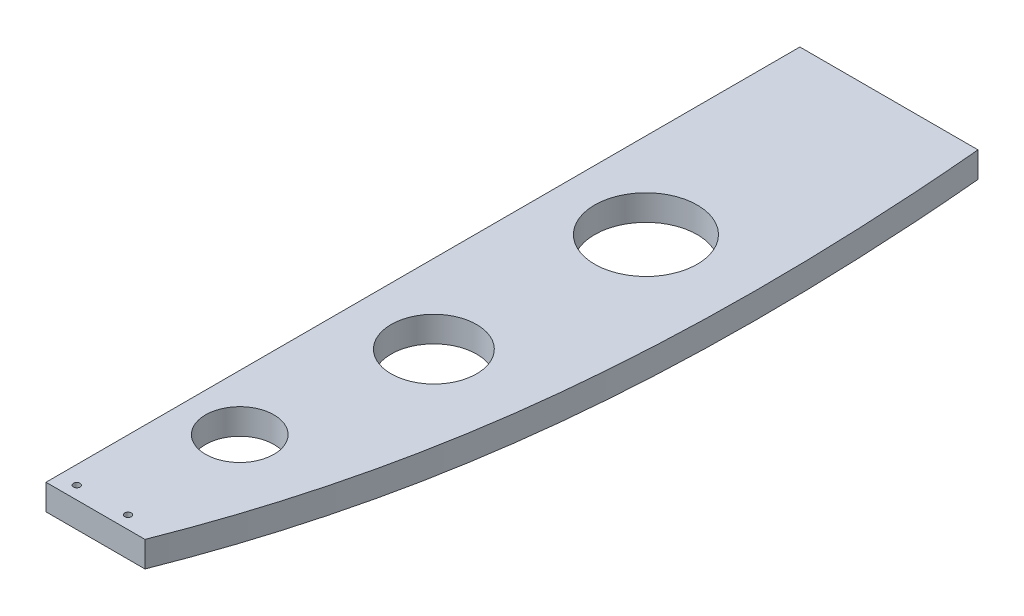
ISO-10303-21;
HEADER;
FILE_DESCRIPTION(('STEP AP214'),'2;1');
FILE_NAME('part.step','',(''),(''),'','','');
FILE_SCHEMA(('AUTOMOTIVE_DESIGN { 1 0 10303 214 1 1 1 1 }'));
ENDSEC;
DATA;
#1=APPLICATION_CONTEXT('core data for automotive mechanical design processes');
#2=APPLICATION_PROTOCOL_DEFINITION('international standard','automotive_design',2000,#1);
#3=PRODUCT_CONTEXT('',#1,'mechanical');
#4=PRODUCT('Part','Part','',(#3));
#5=PRODUCT_RELATED_PRODUCT_CATEGORY('part','',(#4));
#6=PRODUCT_DEFINITION_FORMATION('','',#4);
#7=PRODUCT_DEFINITION_CONTEXT('part definition',#1,'design');
#8=PRODUCT_DEFINITION('design','',#6,#7);
#9=PRODUCT_DEFINITION_SHAPE('','',#8);
#10=(LENGTH_UNIT() NAMED_UNIT(*) SI_UNIT(.MILLI.,.METRE.));
#11=(NAMED_UNIT(*) PLANE_ANGLE_UNIT() SI_UNIT($,.RADIAN.));
#12=(NAMED_UNIT(*) SI_UNIT($,.STERADIAN.) SOLID_ANGLE_UNIT());
#13=UNCERTAINTY_MEASURE_WITH_UNIT(LENGTH_MEASURE(1.E-05),#10,'distance_accuracy_value','');
#14=(GEOMETRIC_REPRESENTATION_CONTEXT(3) GLOBAL_UNCERTAINTY_ASSIGNED_CONTEXT((#13)) GLOBAL_UNIT_ASSIGNED_CONTEXT((#10,
#11,#12)) REPRESENTATION_CONTEXT('',''));
#15=CARTESIAN_POINT('',(0.,0.,0.));
#16=DIRECTION('',(0.,0.,1.));
#17=DIRECTION('',(1.,0.,0.));
#18=AXIS2_PLACEMENT_3D('',#15,#16,#17);
#19=CARTESIAN_POINT('',(395.938510352723,5549.90000000001,2963.39820667187));
#20=DIRECTION('',(0.,1.,0.));
#21=DIRECTION('',(-1.,0.,0.));
#22=AXIS2_PLACEMENT_3D('',#19,#20,#21);
#23=PLANE('',#22);
#24=CARTESIAN_POINT('',(376.52868175482,5549.90000000001,3233.76141324197));
#25=DIRECTION('',(0.,1.,0.));
#26=DIRECTION('',(-1.,0.,0.));
#27=AXIS2_PLACEMENT_3D('',#24,#25,#26);
#28=CIRCLE('',#27,2.45744999999997);
#29=CARTESIAN_POINT('',(374.07123175482,5549.90000000001,3233.76141324197));
#30=VERTEX_POINT('',#29);
#31=EDGE_CURVE('E494',#30,#30,#28,.T.);
#32=ORIENTED_EDGE('',*,*,#31,.T.);
#33=EDGE_LOOP('',(#32));
#34=FACE_BOUND('',#33,.T.);
#35=CARTESIAN_POINT('',(338.428578956983,5549.90000000001,3233.76141324205));
#36=DIRECTION('',(0.,1.,0.));
#37=DIRECTION('',(-1.,0.,0.));
#38=AXIS2_PLACEMENT_3D('',#35,#36,#37);
#39=CIRCLE('',#38,2.45744999999997);
#40=CARTESIAN_POINT('',(335.971128956983,5549.90000000001,3233.76141324205));
#41=VERTEX_POINT('',#40);
#42=EDGE_CURVE('E129',#41,#41,#39,.T.);
#43=ORIENTED_EDGE('',*,*,#42,.T.);
#44=EDGE_LOOP('',(#43));
#45=FACE_BOUND('',#44,.T.);
#46=CARTESIAN_POINT('',(388.619999999984,5549.90000000001,2861.31));
#47=DIRECTION('',(0.,1.,0.));
#48=DIRECTION('',(-1.,0.,0.));
#49=AXIS2_PLACEMENT_3D('',#46,#47,#48);
#50=CIRCLE('',#49,38.0999999999997);
#51=CARTESIAN_POINT('',(350.519999999984,5549.9,2861.31));
#52=VERTEX_POINT('',#51);
#53=EDGE_CURVE('E171',#52,#52,#50,.T.);
#54=ORIENTED_EDGE('',*,*,#53,.T.);
#55=EDGE_LOOP('',(#54));
#56=FACE_BOUND('',#55,.T.);
#57=CARTESIAN_POINT('',(383.539999999985,5549.90000000001,3013.71));
#58=DIRECTION('',(0.,1.,0.));
#59=DIRECTION('',(-1.,0.,0.));
#60=AXIS2_PLACEMENT_3D('',#57,#58,#59);
#61=CIRCLE('',#60,31.75);
#62=CARTESIAN_POINT('',(351.789999999985,5549.90000000001,3013.71));
#63=VERTEX_POINT('',#62);
#64=EDGE_CURVE('E519',#63,#63,#61,.T.);
#65=ORIENTED_EDGE('',*,*,#64,.T.);
#66=EDGE_LOOP('',(#65));
#67=FACE_BOUND('',#66,.T.);
#68=CARTESIAN_POINT('',(366.394999999985,5549.90000000001,3140.71));
#69=DIRECTION('',(0.,1.,0.));
#70=DIRECTION('',(-1.,0.,0.));
#71=AXIS2_PLACEMENT_3D('',#68,#69,#70);
#72=CIRCLE('',#71,25.4);
#73=CARTESIAN_POINT('',(340.994999999985,5549.90000000001,3140.71));
#74=VERTEX_POINT('',#73);
#75=EDGE_CURVE('E185',#74,#74,#72,.T.);
#76=ORIENTED_EDGE('',*,*,#75,.T.);
#77=EDGE_LOOP('',(#76));
#78=FACE_BOUND('',#77,.T.);
#79=DIRECTION('',(0.,0.,1.));
#80=VECTOR('',#79,1.);
#81=CARTESIAN_POINT('',(325.120000000001,5549.90000000001,2683.51));
#82=LINE('',#81,#80);
#83=CARTESIAN_POINT('',(325.120000000001,5549.90000000001,2683.51));
#84=VERTEX_POINT('',#83);
#85=CARTESIAN_POINT('',(325.120000000001,5549.9,3243.28641334377));
#86=VERTEX_POINT('',#85);
#87=EDGE_CURVE('E177',#84,#86,#82,.T.);
#88=ORIENTED_EDGE('',*,*,#87,.F.);
#89=DIRECTION('',(-1.,0.,0.));
#90=VECTOR('',#89,1.);
#91=CARTESIAN_POINT('',(457.383176281735,5549.9,2683.51));
#92=LINE('',#91,#90);
#93=CARTESIAN_POINT('',(457.383176281735,5549.90000000001,2683.51));
#94=VERTEX_POINT('',#93);
#95=EDGE_CURVE('E178',#94,#84,#92,.T.);
#96=ORIENTED_EDGE('',*,*,#95,.F.);
#97=CARTESIAN_POINT('',(398.616067459075,5549.90000000001,3243.28641334377));
#98=CARTESIAN_POINT('',(399.39125435425,5549.90000000001,3241.31643941946));
#99=CARTESIAN_POINT('',(400.159771946542,5549.90000000001,3239.34384037501));
#100=CARTESIAN_POINT('',(401.683308273387,5549.90000000001,3235.39352604281));
#101=CARTESIAN_POINT('',(402.438327540985,5549.90000000001,3233.41581096063));
#102=CARTESIAN_POINT('',(403.934753074234,5549.90000000001,3229.45528302953));
#103=CARTESIAN_POINT('',(404.676159617437,5549.90000000001,3227.47247028548));
#104=CARTESIAN_POINT('',(406.145485254066,5549.90000000001,3223.50115186715));
#105=CARTESIAN_POINT('',(406.873400073381,5549.90000000001,3221.51264461165));
#106=CARTESIAN_POINT('',(408.31540959548,5549.90000000001,3217.53057616089));
#107=CARTESIAN_POINT('',(409.029504010927,5549.90000000001,3215.53701486152));
#108=CARTESIAN_POINT('',(410.443784650398,5549.90000000001,3211.54487773682));
#109=CARTESIAN_POINT('',(411.143970279184,5549.90000000001,3209.54630170097));
#110=CARTESIAN_POINT('',(413.924796825675,5549.90000000001,3201.51873163861));
#111=CARTESIAN_POINT('',(415.948841486583,5549.90000000001,3195.46999950884));
#112=CARTESIAN_POINT('',(419.867867500471,5549.9,3183.33007269645));
#113=CARTESIAN_POINT('',(421.762832082676,5549.9,3177.23887260906));
#114=CARTESIAN_POINT('',(425.422427121146,5549.9,3165.01700514526));
#115=CARTESIAN_POINT('',(427.187049310553,5549.9,3158.88633529227));
#116=CARTESIAN_POINT('',(430.585512685609,5549.9,3146.58889174867));
#117=CARTESIAN_POINT('',(432.219354382258,5549.9,3140.42211819922));
#118=CARTESIAN_POINT('',(435.357372122893,5549.9,3128.05321738844));
#119=CARTESIAN_POINT('',(436.861499329011,5549.9,3121.85107774053));
#120=CARTESIAN_POINT('',(439.740649568869,5549.9,3109.41710957125));
#121=CARTESIAN_POINT('',(441.115676283979,5549.9,3103.18528190178));
#122=CARTESIAN_POINT('',(443.738657817966,5549.9,3090.69501786939));
#123=CARTESIAN_POINT('',(444.986613882393,5549.9,3084.43658176792));
#124=CARTESIAN_POINT('',(447.358070937326,5549.9,3071.89634733286));
#125=CARTESIAN_POINT('',(448.481574270178,5549.90000000001,3065.61454944128));
#126=CARTESIAN_POINT('',(450.959202772402,5549.90000000001,3050.94728471009));
#127=CARTESIAN_POINT('',(452.266536668404,5549.90000000001,3042.553883485));
#128=CARTESIAN_POINT('',(454.674970323465,5549.9,3025.73760485585));
#129=CARTESIAN_POINT('',(455.776068123823,5549.9,3017.3147271726));
#130=CARTESIAN_POINT('',(457.781734473297,5549.9,3000.44559812988));
#131=CARTESIAN_POINT('',(458.686301386226,5549.9,2991.99934657639));
#132=CARTESIAN_POINT('',(460.309158182782,5549.9,2975.08983570134));
#133=CARTESIAN_POINT('',(461.027464844443,5549.9,2966.62657798091));
#134=CARTESIAN_POINT('',(462.288581630137,5549.9,2949.68715658898));
#135=CARTESIAN_POINT('',(462.831394684958,5549.9,2941.21099313539));
#136=CARTESIAN_POINT('',(463.522040592226,5549.9,2928.49034900381));
#137=CARTESIAN_POINT('',(463.731658636719,5549.9,2924.2491150432));
#138=CARTESIAN_POINT('',(464.111045111049,5549.90000000001,2915.76485644083));
#139=CARTESIAN_POINT('',(464.280813611038,5549.90000000001,2911.52183180224));
#140=CARTESIAN_POINT('',(464.54389378274,5549.90000000001,2904.10341936462));
#141=CARTESIAN_POINT('',(464.645692509933,5549.9,2900.92832853059));
#142=CARTESIAN_POINT('',(464.782642510266,5549.9,2896.16524637707));
#143=CARTESIAN_POINT('',(464.825667804946,5549.9,2894.57747907897));
#144=CARTESIAN_POINT('',(464.906437301378,5549.9,2891.40180867515));
#145=CARTESIAN_POINT('',(464.944181497303,5549.9,2889.81390556928));
#146=CARTESIAN_POINT('',(465.049630713982,5549.9,2885.05012986422));
#147=CARTESIAN_POINT('',(465.109555502827,5549.9,2881.87408139542));
#148=CARTESIAN_POINT('',(465.209293669797,5549.9,2875.52166888438));
#149=CARTESIAN_POINT('',(465.24910699861,5549.9,2872.34530484138));
#150=CARTESIAN_POINT('',(465.339279193303,5549.9,2862.81707241095));
#151=CARTESIAN_POINT('',(465.360395446423,5549.9,2856.46490585253));
#152=CARTESIAN_POINT('',(465.328911747633,5549.9,2843.76069302108));
#153=CARTESIAN_POINT('',(465.276310667107,5549.90000000001,2837.40864675138));
#154=CARTESIAN_POINT('',(465.103717150511,5549.90000000001,2824.90056477656));
#155=CARTESIAN_POINT('',(464.985843659627,5549.9,2818.74449953624));
#156=CARTESIAN_POINT('',(464.687072530092,5549.9,2806.4337998571));
#157=CARTESIAN_POINT('',(464.506173786314,5549.9,2800.27916544525));
#158=CARTESIAN_POINT('',(464.08372728867,5549.9,2787.97184820663));
#159=CARTESIAN_POINT('',(463.842178185526,5549.9,2781.81916542631));
#160=CARTESIAN_POINT('',(463.300390781292,5549.9,2769.51628781189));
#161=CARTESIAN_POINT('',(463.000151506004,5549.9,2763.36609302079));
#162=CARTESIAN_POINT('',(462.342479114976,5549.9,2751.06749509507));
#163=CARTESIAN_POINT('',(461.985034229911,5549.9,2744.91909259054));
#164=CARTESIAN_POINT('',(461.214161076097,5549.9,2732.62589828629));
#165=CARTESIAN_POINT('',(460.80073366799,5549.9,2726.48110643251));
#166=CARTESIAN_POINT('',(459.918658659863,5549.9,2714.19573926707));
#167=CARTESIAN_POINT('',(459.450013380929,5549.9,2708.05516378909));
#168=CARTESIAN_POINT('',(458.705858250389,5549.9,2698.84786595679));
#169=CARTESIAN_POINT('',(458.450951410518,5549.9,2695.77946560644));
#170=CARTESIAN_POINT('',(457.927384186114,5549.9,2689.64383870023));
#171=CARTESIAN_POINT('',(457.658723802266,5549.90000000001,2686.57661214431));
#172=CARTESIAN_POINT('',(457.383176281735,5549.90000000001,2683.51));
#173=B_SPLINE_CURVE_WITH_KNOTS('',3,(#97,#98,#99,#100,#101,#102,#103,#104,#105,#106,#107,#108,
#109,#110,#111,#112,#113,#114,#115,#116,#117,#118,#119,#120,#121,#122,#123,#124,#125,#126,#127,
#128,#129,#130,#131,#132,#133,#134,#135,#136,#137,#138,#139,#140,#141,#142,#143,#144,#145,#146,
#147,#148,#149,#150,#151,#152,#153,#154,#155,#156,#157,#158,#159,#160,#161,#162,#163,#164,#165,
#166,#167,#168,#169,#170,#171,#172),.UNSPECIFIED.,.F.,.F.,(4,2,2,2,2,2,2,2,2,2,2,2,2,2,2,2,2,2,
2,2,2,2,2,2,2,2,2,2,2,2,2,2,2,2,2,2,2,4),(0.,6.35100513389873,12.7017589115667,19.0523830586232,
25.4049858028804,31.7577204810335,38.1107264467625,57.2443005221599,76.3803558108261,
95.5176237474079,114.654816904936,133.799184095803,152.943005208753,172.086638655153,
191.229911734633,216.710911962582,242.192154180931,267.673608531117,293.152766753605,
318.631499445493,331.370582215211,344.109642558367,353.639740098638,358.404782446425,
363.169830052399,372.699596689318,382.229386692556,401.285492509783,420.341890080029,
438.813133582084,457.284700987462,475.756679362759,494.228964380042,512.705054731664,
531.18086107531,549.655891064216,558.892775373888,568.129659224018),.UNSPECIFIED.);
#174=CARTESIAN_POINT('',(398.616067459075,5549.90000000001,3243.28641334377));
#175=VERTEX_POINT('',#174);
#176=EDGE_CURVE('E96',#175,#94,#173,.T.);
#177=ORIENTED_EDGE('',*,*,#176,.F.);
#178=DIRECTION('',(1.,0.,0.));
#179=VECTOR('',#178,1.);
#180=CARTESIAN_POINT('',(325.120000000001,5549.9,3243.28641334377));
#181=LINE('',#180,#179);
#182=EDGE_CURVE('E203',#86,#175,#181,.T.);
#183=ORIENTED_EDGE('',*,*,#182,.F.);
#184=EDGE_LOOP('',(#88,#96,#177,#183));
#185=FACE_BOUND('',#184,.T.);
#186=ADVANCED_FACE('F50',(#34,#45,#56,#67,#78,#185),#23,.F.);
#187=CARTESIAN_POINT('',(325.120000000001,5549.9,3243.28641334377));
#188=DIRECTION('',(0.,0.,1.));
#189=DIRECTION('',(1.,0.,0.));
#190=AXIS2_PLACEMENT_3D('',#187,#188,#189);
#191=PLANE('',#190);
#192=DIRECTION('',(-1.,0.,0.));
#193=VECTOR('',#192,1.);
#194=CARTESIAN_POINT('',(395.938510352722,5568.95,3243.28641334377));
#195=LINE('',#194,#193);
#196=CARTESIAN_POINT('',(325.120000000001,5568.95000000001,3243.28641334377));
#197=VERTEX_POINT('',#196);
#198=CARTESIAN_POINT('',(398.616067459078,5568.95000000001,3243.28641334377));
#199=VERTEX_POINT('',#198);
#200=EDGE_CURVE('E168',#197,#199,#195,.F.);
#201=ORIENTED_EDGE('',*,*,#200,.F.);
#202=DIRECTION('',(0.,-1.,0.));
#203=VECTOR('',#202,1.);
#204=CARTESIAN_POINT('',(325.120000000001,5549.9,3243.28641334377));
#205=LINE('',#204,#203);
#206=EDGE_CURVE('E186',#86,#197,#205,.F.);
#207=ORIENTED_EDGE('',*,*,#206,.F.);
#208=ORIENTED_EDGE('',*,*,#182,.T.);
#209=DIRECTION('',(-1.36946010087513E-13,-1.,0.));
#210=VECTOR('',#209,1.);
#211=CARTESIAN_POINT('',(398.616067459077,5559.425,3243.28641334377));
#212=LINE('',#211,#210);
#213=EDGE_CURVE('E189',#199,#175,#212,.T.);
#214=ORIENTED_EDGE('',*,*,#213,.F.);
#215=EDGE_LOOP('',(#201,#207,#208,#214));
#216=FACE_BOUND('',#215,.T.);
#217=ADVANCED_FACE('F247',(#216),#191,.T.);
#218=CARTESIAN_POINT('',(398.616067459075,5549.90000000001,3243.28641334377));
#219=CARTESIAN_POINT('',(398.616067459078,5568.95000000001,3243.28641334377));
#220=CARTESIAN_POINT('',(438.958601174541,5549.90000000001,3140.76412449457));
#221=CARTESIAN_POINT('',(438.958601174543,5568.95000000001,3140.76412449457));
#222=CARTESIAN_POINT('',(461.136779739803,5549.90000000001,3031.41462020299));
#223=CARTESIAN_POINT('',(461.136779739804,5568.95000000001,3031.41462020298));
#224=CARTESIAN_POINT('',(466.748734721919,5549.90000000001,2823.19952309335));
#225=CARTESIAN_POINT('',(466.748734721919,5568.95000000001,2823.19952309334));
#226=CARTESIAN_POINT('',(463.282210542619,5549.90000000001,2749.16015817367));
#227=CARTESIAN_POINT('',(463.282210542618,5568.95000000001,2749.16015817367));
#228=CARTESIAN_POINT('',(457.383176281735,5549.9,2683.51));
#229=CARTESIAN_POINT('',(457.383176281734,5568.95000000001,2683.51));
#230=B_SPLINE_SURFACE_WITH_KNOTS('',3,1,((#218,#219),(#220,#221),(#222,#223),(#224,#225),(#226,
#227),(#228,#229)),.UNSPECIFIED.,.F.,.F.,.F.,(4,2,4),(2,2),(-55.3716029639308,-25.0699273348478,
-9.0667694452729),(0.,1.90499999999997),.UNSPECIFIED.);
#231=CARTESIAN_POINT('',(398.616067459077,5568.95000000001,3243.28641334377));
#232=CARTESIAN_POINT('',(399.391254354253,5568.95000000001,3241.31643941946));
#233=CARTESIAN_POINT('',(400.159771946545,5568.95000000001,3239.34384037501));
#234=CARTESIAN_POINT('',(401.68330827339,5568.95000000001,3235.39352604281));
#235=CARTESIAN_POINT('',(402.438327540988,5568.95000000001,3233.41581096063));
#236=CARTESIAN_POINT('',(403.934753074237,5568.95000000001,3229.45528302953));
#237=CARTESIAN_POINT('',(404.67615961744,5568.95000000001,3227.47247028548));
#238=CARTESIAN_POINT('',(406.145485254069,5568.95000000001,3223.50115186715));
#239=CARTESIAN_POINT('',(406.873400073384,5568.95000000001,3221.51264461165));
#240=CARTESIAN_POINT('',(408.315409595483,5568.95000000001,3217.53057616089));
#241=CARTESIAN_POINT('',(409.02950401093,5568.95000000001,3215.53701486152));
#242=CARTESIAN_POINT('',(410.443784650401,5568.95000000001,3211.54487773681));
#243=CARTESIAN_POINT('',(411.143970279187,5568.95000000001,3209.54630170097));
#244=CARTESIAN_POINT('',(413.924796825676,5568.95000000001,3201.51873163861));
#245=CARTESIAN_POINT('',(415.948841486585,5568.95000000001,3195.46999950884));
#246=CARTESIAN_POINT('',(419.867867500474,5568.95000000001,3183.33007269644));
#247=CARTESIAN_POINT('',(421.762832082679,5568.95000000001,3177.23887260906));
#248=CARTESIAN_POINT('',(425.422427121148,5568.95000000001,3165.01700514526));
#249=CARTESIAN_POINT('',(427.187049310556,5568.95000000001,3158.88633529227));
#250=CARTESIAN_POINT('',(430.585512685611,5568.95000000001,3146.58889174867));
#251=CARTESIAN_POINT('',(432.219354382261,5568.95000000001,3140.42211819922));
#252=CARTESIAN_POINT('',(435.357372122895,5568.95000000001,3128.05321738843));
#253=CARTESIAN_POINT('',(436.861499329013,5568.95000000001,3121.85107774053));
#254=CARTESIAN_POINT('',(439.740649568871,5568.95000000001,3109.41710957125));
#255=CARTESIAN_POINT('',(441.115676283981,5568.95000000001,3103.18528190178));
#256=CARTESIAN_POINT('',(443.738657817968,5568.95000000001,3090.69501786939));
#257=CARTESIAN_POINT('',(444.986613882395,5568.95000000001,3084.43658176791));
#258=CARTESIAN_POINT('',(447.358070937328,5568.95000000001,3071.89634733286));
#259=CARTESIAN_POINT('',(448.481574270179,5568.95000000001,3065.61454944128));
#260=CARTESIAN_POINT('',(450.959202772402,5568.95000000001,3050.94728471009));
#261=CARTESIAN_POINT('',(452.266536668405,5568.95000000001,3042.553883485));
#262=CARTESIAN_POINT('',(454.674970323467,5568.95000000001,3025.73760485585));
#263=CARTESIAN_POINT('',(455.776068123825,5568.95000000001,3017.3147271726));
#264=CARTESIAN_POINT('',(457.781734473297,5568.95000000001,3000.44559812987));
#265=CARTESIAN_POINT('',(458.686301386227,5568.95000000001,2991.99934657639));
#266=CARTESIAN_POINT('',(460.309158182783,5568.95000000001,2975.08983570133));
#267=CARTESIAN_POINT('',(461.027464844444,5568.95000000001,2966.62657798091));
#268=CARTESIAN_POINT('',(462.288581630137,5568.95000000001,2949.68715658898));
#269=CARTESIAN_POINT('',(462.831394684958,5568.95000000001,2941.21099313538));
#270=CARTESIAN_POINT('',(463.522040592227,5568.95000000001,2928.49034900381));
#271=CARTESIAN_POINT('',(463.73165863672,5568.95,2924.2491150432));
#272=CARTESIAN_POINT('',(464.111045111049,5568.95000000001,2915.76485644083));
#273=CARTESIAN_POINT('',(464.280813611037,5568.95000000001,2911.52183180224));
#274=CARTESIAN_POINT('',(464.543893782738,5568.95000000001,2904.10341936462));
#275=CARTESIAN_POINT('',(464.645692509933,5568.95000000001,2900.92832853059));
#276=CARTESIAN_POINT('',(464.782642510266,5568.95000000001,2896.16524637706));
#277=CARTESIAN_POINT('',(464.825667804946,5568.95000000001,2894.57747907896));
#278=CARTESIAN_POINT('',(464.906437301378,5568.95000000001,2891.40180867514));
#279=CARTESIAN_POINT('',(464.944181497303,5568.95000000001,2889.81390556928));
#280=CARTESIAN_POINT('',(465.049630713982,5568.95000000001,2885.05012986421));
#281=CARTESIAN_POINT('',(465.109555502827,5568.95000000001,2881.87408139542));
#282=CARTESIAN_POINT('',(465.209293669797,5568.95000000001,2875.52166888438));
#283=CARTESIAN_POINT('',(465.24910699861,5568.95000000001,2872.34530484138));
#284=CARTESIAN_POINT('',(465.339279193303,5568.95000000001,2862.81707241095));
#285=CARTESIAN_POINT('',(465.360395446423,5568.95000000001,2856.46490585253));
#286=CARTESIAN_POINT('',(465.328911747633,5568.95000000001,2843.76069302108));
#287=CARTESIAN_POINT('',(465.276310667106,5568.95000000001,2837.40864675138));
#288=CARTESIAN_POINT('',(465.10371715051,5568.95000000001,2824.90056477656));
#289=CARTESIAN_POINT('',(464.985843659626,5568.95000000001,2818.74449953624));
#290=CARTESIAN_POINT('',(464.687072530091,5568.95000000001,2806.43379985709));
#291=CARTESIAN_POINT('',(464.506173786314,5568.95000000001,2800.27916544525));
#292=CARTESIAN_POINT('',(464.08372728867,5568.95000000001,2787.97184820662));
#293=CARTESIAN_POINT('',(463.842178185526,5568.95000000001,2781.81916542631));
#294=CARTESIAN_POINT('',(463.300390781291,5568.95000000001,2769.51628781189));
#295=CARTESIAN_POINT('',(463.000151506003,5568.95000000001,2763.36609302079));
#296=CARTESIAN_POINT('',(462.342479114976,5568.95000000001,2751.06749509507));
#297=CARTESIAN_POINT('',(461.985034229911,5568.95000000001,2744.91909259054));
#298=CARTESIAN_POINT('',(461.214161076097,5568.95000000001,2732.62589828629));
#299=CARTESIAN_POINT('',(460.800733667989,5568.95000000001,2726.48110643251));
#300=CARTESIAN_POINT('',(459.918658659862,5568.95000000001,2714.19573926707));
#301=CARTESIAN_POINT('',(459.450013380929,5568.95000000001,2708.05516378908));
#302=CARTESIAN_POINT('',(458.705858250388,5568.95000000001,2698.84786595679));
#303=CARTESIAN_POINT('',(458.450951410518,5568.95000000001,2695.77946560644));
#304=CARTESIAN_POINT('',(457.927384186114,5568.95000000001,2689.64383870023));
#305=CARTESIAN_POINT('',(457.658723802266,5568.95000000001,2686.57661214431));
#306=CARTESIAN_POINT('',(457.383176281735,5568.95000000001,2683.51));
#307=B_SPLINE_CURVE_WITH_KNOTS('',3,(#231,#232,#233,#234,#235,#236,#237,#238,#239,#240,#241,
#242,#243,#244,#245,#246,#247,#248,#249,#250,#251,#252,#253,#254,#255,#256,#257,#258,#259,#260,
#261,#262,#263,#264,#265,#266,#267,#268,#269,#270,#271,#272,#273,#274,#275,#276,#277,#278,#279,
#280,#281,#282,#283,#284,#285,#286,#287,#288,#289,#290,#291,#292,#293,#294,#295,#296,#297,#298,
#299,#300,#301,#302,#303,#304,#305,#306),.UNSPECIFIED.,.F.,.F.,(4,2,2,2,2,2,2,2,2,2,2,2,2,2,2,2,
2,2,2,2,2,2,2,2,2,2,2,2,2,2,2,2,2,2,2,2,2,4),(0.,6.35100513389902,12.7017589115678,
19.0523830586243,25.4049858028811,31.757720481036,38.1107264467646,57.2443005221618,
76.3803558108284,95.5176237474105,114.654816904938,133.799184095806,152.943005208755,
172.086638655155,191.229911734635,216.710911962584,242.192154180932,267.673608531119,
293.152766753607,318.631499445496,331.370582215213,344.109642558369,353.639740098641,
358.404782446427,363.169830052401,372.69959668932,382.229386692558,401.285492509785,
420.341890080031,438.813133582085,457.284700987464,475.756679362759,494.228964380042,
512.705054731665,531.18086107531,549.655891064216,558.892775373888,568.129659224018),.UNSPECIFIED.);
#308=CARTESIAN_POINT('',(457.383176281735,5568.95000000001,2683.51));
#309=VERTEX_POINT('',#308);
#310=EDGE_CURVE('E165',#199,#309,#307,.T.);
#311=DIRECTION('',(0.,1.,0.));
#312=VECTOR('',#311,1.);
#313=CARTESIAN_POINT('',(457.383176281735,5549.9,2683.51));
#314=LINE('',#313,#312);
#315=EDGE_CURVE('E174',#309,#94,#314,.F.);
#316=ORIENTED_EDGE('',*,*,#310,.F.);
#317=ORIENTED_EDGE('',*,*,#213,.T.);
#318=ORIENTED_EDGE('',*,*,#176,.T.);
#319=ORIENTED_EDGE('',*,*,#315,.F.);
#320=EDGE_LOOP('',(#316,#317,#318,#319));
#321=FACE_BOUND('',#320,.T.);
#322=ADVANCED_FACE('F52',(#321),#230,.T.);
#323=CARTESIAN_POINT('',(457.383176281735,5549.9,2683.51));
#324=DIRECTION('',(0.,0.,-1.));
#325=DIRECTION('',(-1.,0.,0.));
#326=AXIS2_PLACEMENT_3D('',#323,#324,#325);
#327=PLANE('',#326);
#328=CARTESIAN_POINT('',(424.072610901229,5559.42500000001,2683.51));
#329=DIRECTION('',(0.,0.,-1.));
#330=DIRECTION('',(-1.,0.,0.));
#331=AXIS2_PLACEMENT_3D('',#328,#329,#330);
#332=CIRCLE('',#331,0.991870000000006);
#333=CARTESIAN_POINT('',(423.080740901229,5559.42500000001,2683.51));
#334=VERTEX_POINT('',#333);
#335=EDGE_CURVE('E156',#334,#334,#332,.T.);
#336=ORIENTED_EDGE('',*,*,#335,.F.);
#337=EDGE_LOOP('',(#336));
#338=FACE_BOUND('',#337,.T.);
#339=CARTESIAN_POINT('',(358.104203633743,5559.42500000001,2683.51));
#340=DIRECTION('',(0.,0.,-1.));
#341=DIRECTION('',(-1.,0.,0.));
#342=AXIS2_PLACEMENT_3D('',#339,#340,#341);
#343=CIRCLE('',#342,0.991870000000006);
#344=CARTESIAN_POINT('',(357.112333633743,5559.42500000001,2683.51));
#345=VERTEX_POINT('',#344);
#346=EDGE_CURVE('E160',#345,#345,#343,.T.);
#347=ORIENTED_EDGE('',*,*,#346,.F.);
#348=EDGE_LOOP('',(#347));
#349=FACE_BOUND('',#348,.T.);
#350=DIRECTION('',(-1.,0.,0.));
#351=VECTOR('',#350,1.);
#352=CARTESIAN_POINT('',(395.938510352722,5568.95000000001,2683.51));
#353=LINE('',#352,#351);
#354=CARTESIAN_POINT('',(325.120000000001,5568.95000000001,2683.51));
#355=VERTEX_POINT('',#354);
#356=EDGE_CURVE('E161',#309,#355,#353,.T.);
#357=ORIENTED_EDGE('',*,*,#356,.F.);
#358=ORIENTED_EDGE('',*,*,#315,.T.);
#359=ORIENTED_EDGE('',*,*,#95,.T.);
#360=DIRECTION('',(0.,-1.,0.));
#361=VECTOR('',#360,1.);
#362=CARTESIAN_POINT('',(325.120000000001,5549.90000000001,2683.51));
#363=LINE('',#362,#361);
#364=EDGE_CURVE('E72',#355,#84,#363,.T.);
#365=ORIENTED_EDGE('',*,*,#364,.F.);
#366=EDGE_LOOP('',(#357,#358,#359,#365));
#367=FACE_BOUND('',#366,.T.);
#368=ADVANCED_FACE('F242',(#338,#349,#367),#327,.T.);
#369=CARTESIAN_POINT('',(325.120000000001,5549.90000000001,2683.51));
#370=DIRECTION('',(-1.,0.,0.));
#371=DIRECTION('',(0.,-1.,0.));
#372=AXIS2_PLACEMENT_3D('',#369,#370,#371);
#373=PLANE('',#372);
#374=CARTESIAN_POINT('',(325.120000000001,5559.42500000001,2785.11));
#375=DIRECTION('',(-1.,0.,0.));
#376=DIRECTION('',(0.,-1.,0.));
#377=AXIS2_PLACEMENT_3D('',#374,#375,#376);
#378=CIRCLE('',#377,0.991870000000006);
#379=CARTESIAN_POINT('',(325.120000000001,5558.43313000001,2785.11));
#380=VERTEX_POINT('',#379);
#381=EDGE_CURVE('E57',#380,#380,#378,.T.);
#382=ORIENTED_EDGE('',*,*,#381,.F.);
#383=EDGE_LOOP('',(#382));
#384=FACE_BOUND('',#383,.T.);
#385=CARTESIAN_POINT('',(325.12,5559.42500000001,2886.71));
#386=DIRECTION('',(-1.,0.,0.));
#387=DIRECTION('',(0.,-1.,0.));
#388=AXIS2_PLACEMENT_3D('',#385,#386,#387);
#389=CIRCLE('',#388,0.991870000000006);
#390=CARTESIAN_POINT('',(325.119999999999,5558.43313000001,2886.71));
#391=VERTEX_POINT('',#390);
#392=EDGE_CURVE('E140',#391,#391,#389,.T.);
#393=ORIENTED_EDGE('',*,*,#392,.F.);
#394=EDGE_LOOP('',(#393));
#395=FACE_BOUND('',#394,.T.);
#396=CARTESIAN_POINT('',(325.120000000003,5559.42500000001,2988.31));
#397=DIRECTION('',(-1.,0.,0.));
#398=DIRECTION('',(0.,-1.,0.));
#399=AXIS2_PLACEMENT_3D('',#396,#397,#398);
#400=CIRCLE('',#399,0.991870000000006);
#401=CARTESIAN_POINT('',(325.120000000003,5558.43313000001,2988.31));
#402=VERTEX_POINT('',#401);
#403=EDGE_CURVE('E144',#402,#402,#400,.T.);
#404=ORIENTED_EDGE('',*,*,#403,.F.);
#405=EDGE_LOOP('',(#404));
#406=FACE_BOUND('',#405,.T.);
#407=CARTESIAN_POINT('',(325.120000000002,5559.42500000001,3089.91));
#408=DIRECTION('',(-1.,0.,0.));
#409=DIRECTION('',(0.,-1.,0.));
#410=AXIS2_PLACEMENT_3D('',#407,#408,#409);
#411=CIRCLE('',#410,0.991870000000006);
#412=CARTESIAN_POINT('',(325.120000000002,5558.43313000001,3089.91));
#413=VERTEX_POINT('',#412);
#414=EDGE_CURVE('E148',#413,#413,#411,.T.);
#415=ORIENTED_EDGE('',*,*,#414,.F.);
#416=EDGE_LOOP('',(#415));
#417=FACE_BOUND('',#416,.T.);
#418=CARTESIAN_POINT('',(325.120000000001,5559.42500000001,3191.51));
#419=DIRECTION('',(-1.,0.,0.));
#420=DIRECTION('',(0.,-1.,0.));
#421=AXIS2_PLACEMENT_3D('',#418,#419,#420);
#422=CIRCLE('',#421,0.991870000000006);
#423=CARTESIAN_POINT('',(325.120000000001,5558.43313000001,3191.51));
#424=VERTEX_POINT('',#423);
#425=EDGE_CURVE('E152',#424,#424,#422,.T.);
#426=ORIENTED_EDGE('',*,*,#425,.F.);
#427=EDGE_LOOP('',(#426));
#428=FACE_BOUND('',#427,.T.);
#429=DIRECTION('',(0.,0.,1.));
#430=VECTOR('',#429,1.);
#431=CARTESIAN_POINT('',(325.120000000002,5568.95000000001,2963.39820667187));
#432=LINE('',#431,#430);
#433=EDGE_CURVE('E164',#355,#197,#432,.T.);
#434=ORIENTED_EDGE('',*,*,#433,.F.);
#435=ORIENTED_EDGE('',*,*,#364,.T.);
#436=ORIENTED_EDGE('',*,*,#87,.T.);
#437=ORIENTED_EDGE('',*,*,#206,.T.);
#438=EDGE_LOOP('',(#434,#435,#436,#437));
#439=FACE_BOUND('',#438,.T.);
#440=ADVANCED_FACE('F238',(#384,#395,#406,#417,#428,#439),#373,.T.);
#441=CARTESIAN_POINT('',(366.395000000001,5194.30000000001,3140.71));
#442=DIRECTION('',(0.,1.,0.));
#443=DIRECTION('',(-1.,0.,0.));
#444=AXIS2_PLACEMENT_3D('',#441,#442,#443);
#445=CYLINDRICAL_SURFACE('',#444,25.4);
#446=ORIENTED_EDGE('',*,*,#75,.F.);
#447=EDGE_LOOP('',(#446));
#448=FACE_BOUND('',#447,.T.);
#449=CARTESIAN_POINT('',(366.394999999984,5568.95000000001,3140.71));
#450=DIRECTION('',(0.,1.,0.));
#451=DIRECTION('',(-1.,0.,0.));
#452=AXIS2_PLACEMENT_3D('',#449,#450,#451);
#453=CIRCLE('',#452,25.4);
#454=CARTESIAN_POINT('',(340.994999999984,5568.95000000001,3140.71));
#455=VERTEX_POINT('',#454);
#456=EDGE_CURVE('E181',#455,#455,#453,.F.);
#457=ORIENTED_EDGE('',*,*,#456,.F.);
#458=EDGE_LOOP('',(#457));
#459=FACE_BOUND('',#458,.T.);
#460=ADVANCED_FACE('F234',(#448,#459),#445,.F.);
#461=CARTESIAN_POINT('',(383.54,5194.3,3013.71));
#462=DIRECTION('',(0.,1.,0.));
#463=DIRECTION('',(-1.,0.,0.));
#464=AXIS2_PLACEMENT_3D('',#461,#462,#463);
#465=CYLINDRICAL_SURFACE('',#464,31.75);
#466=ORIENTED_EDGE('',*,*,#64,.F.);
#467=EDGE_LOOP('',(#466));
#468=FACE_BOUND('',#467,.T.);
#469=CARTESIAN_POINT('',(383.539999999986,5568.95000000001,3013.71));
#470=DIRECTION('',(0.,1.,0.));
#471=DIRECTION('',(-1.,0.,0.));
#472=AXIS2_PLACEMENT_3D('',#469,#470,#471);
#473=CIRCLE('',#472,31.75);
#474=CARTESIAN_POINT('',(351.789999999986,5568.95000000001,3013.71));
#475=VERTEX_POINT('',#474);
#476=EDGE_CURVE('E63',#475,#475,#473,.F.);
#477=ORIENTED_EDGE('',*,*,#476,.F.);
#478=EDGE_LOOP('',(#477));
#479=FACE_BOUND('',#478,.T.);
#480=ADVANCED_FACE('F230',(#468,#479),#465,.F.);
#481=CARTESIAN_POINT('',(388.620000000001,5194.30000000001,2861.31));
#482=DIRECTION('',(0.,1.,0.));
#483=DIRECTION('',(-1.,0.,0.));
#484=AXIS2_PLACEMENT_3D('',#481,#482,#483);
#485=CYLINDRICAL_SURFACE('',#484,38.0999999999997);
#486=ORIENTED_EDGE('',*,*,#53,.F.);
#487=EDGE_LOOP('',(#486));
#488=FACE_BOUND('',#487,.T.);
#489=CARTESIAN_POINT('',(388.619999999984,5568.95000000001,2861.31));
#490=DIRECTION('',(0.,1.,0.));
#491=DIRECTION('',(-1.,0.,0.));
#492=AXIS2_PLACEMENT_3D('',#489,#490,#491);
#493=CIRCLE('',#492,38.0999999999997);
#494=CARTESIAN_POINT('',(350.519999999984,5568.95000000001,2861.31));
#495=VERTEX_POINT('',#494);
#496=EDGE_CURVE('E13',#495,#495,#493,.F.);
#497=ORIENTED_EDGE('',*,*,#496,.F.);
#498=EDGE_LOOP('',(#497));
#499=FACE_BOUND('',#498,.T.);
#500=ADVANCED_FACE('F225',(#488,#499),#485,.F.);
#501=CARTESIAN_POINT('',(395.938510352725,5568.95000000001,2963.39820667187));
#502=DIRECTION('',(0.,1.,0.));
#503=DIRECTION('',(-1.,0.,0.));
#504=AXIS2_PLACEMENT_3D('',#501,#502,#503);
#505=PLANE('',#504);
#506=CARTESIAN_POINT('',(376.52868175482,5568.95000000001,3233.76141324196));
#507=DIRECTION('',(0.,1.,0.));
#508=DIRECTION('',(0.,0.,1.));
#509=AXIS2_PLACEMENT_3D('',#506,#507,#508);
#510=CIRCLE('',#509,2.45744999999997);
#511=CARTESIAN_POINT('',(376.52868175482,5568.95000000001,3236.21886324196));
#512=VERTEX_POINT('',#511);
#513=EDGE_CURVE('E491',#512,#512,#510,.T.);
#514=ORIENTED_EDGE('',*,*,#513,.F.);
#515=EDGE_LOOP('',(#514));
#516=FACE_BOUND('',#515,.T.);
#517=CARTESIAN_POINT('',(338.428578956983,5568.95000000001,3233.76141324205));
#518=DIRECTION('',(0.,1.,0.));
#519=DIRECTION('',(0.,0.,1.));
#520=AXIS2_PLACEMENT_3D('',#517,#518,#519);
#521=CIRCLE('',#520,2.45744999999997);
#522=CARTESIAN_POINT('',(338.428578956983,5568.95000000001,3236.21886324205));
#523=VERTEX_POINT('',#522);
#524=EDGE_CURVE('E134',#523,#523,#521,.T.);
#525=ORIENTED_EDGE('',*,*,#524,.F.);
#526=EDGE_LOOP('',(#525));
#527=FACE_BOUND('',#526,.T.);
#528=ORIENTED_EDGE('',*,*,#496,.T.);
#529=EDGE_LOOP('',(#528));
#530=FACE_BOUND('',#529,.T.);
#531=ORIENTED_EDGE('',*,*,#476,.T.);
#532=EDGE_LOOP('',(#531));
#533=FACE_BOUND('',#532,.T.);
#534=ORIENTED_EDGE('',*,*,#456,.T.);
#535=EDGE_LOOP('',(#534));
#536=FACE_BOUND('',#535,.T.);
#537=ORIENTED_EDGE('',*,*,#356,.T.);
#538=ORIENTED_EDGE('',*,*,#433,.T.);
#539=ORIENTED_EDGE('',*,*,#200,.T.);
#540=ORIENTED_EDGE('',*,*,#310,.T.);
#541=EDGE_LOOP('',(#537,#538,#539,#540));
#542=FACE_BOUND('',#541,.T.);
#543=ADVANCED_FACE('F219',(#516,#527,#530,#533,#536,#542),#505,.T.);
#544=CARTESIAN_POINT('',(358.104203633743,5559.42500000001,2702.56));
#545=DIRECTION('',(0.,0.,-1.));
#546=DIRECTION('',(-1.,0.,0.));
#547=AXIS2_PLACEMENT_3D('',#544,#545,#546);
#548=CONICAL_SURFACE('',#547,0.991870000000006,1.02974425867677);
#549=CARTESIAN_POINT('',(358.104203633743,5559.42500000001,2703.1559756222));
#550=VERTEX_POINT('',#549);
#551=VERTEX_LOOP('',#550);
#552=FACE_BOUND('',#551,.T.);
#553=CARTESIAN_POINT('',(358.104203633743,5559.42500000001,2702.56));
#554=DIRECTION('',(0.,0.,-1.));
#555=DIRECTION('',(-1.,0.,0.));
#556=AXIS2_PLACEMENT_3D('',#553,#554,#555);
#557=CIRCLE('',#556,0.991870000000006);
#558=CARTESIAN_POINT('',(357.112333633743,5559.42500000001,2702.56));
#559=VERTEX_POINT('',#558);
#560=EDGE_CURVE('E157',#559,#559,#557,.T.);
#561=ORIENTED_EDGE('',*,*,#560,.T.);
#562=EDGE_LOOP('',(#561));
#563=FACE_BOUND('',#562,.T.);
#564=ADVANCED_FACE('F224',(#552,#563),#548,.F.);
#565=CARTESIAN_POINT('',(358.104203633743,5559.42500000001,2664.46));
#566=DIRECTION('',(0.,0.,-1.));
#567=DIRECTION('',(-1.,0.,0.));
#568=AXIS2_PLACEMENT_3D('',#565,#566,#567);
#569=CYLINDRICAL_SURFACE('',#568,0.991870000000006);
#570=ORIENTED_EDGE('',*,*,#346,.T.);
#571=EDGE_LOOP('',(#570));
#572=FACE_BOUND('',#571,.T.);
#573=ORIENTED_EDGE('',*,*,#560,.F.);
#574=EDGE_LOOP('',(#573));
#575=FACE_BOUND('',#574,.T.);
#576=ADVANCED_FACE('F320',(#572,#575),#569,.F.);
#577=CARTESIAN_POINT('',(424.072610901228,5559.42500000001,2702.56));
#578=DIRECTION('',(0.,0.,-1.));
#579=DIRECTION('',(-1.,0.,0.));
#580=AXIS2_PLACEMENT_3D('',#577,#578,#579);
#581=CONICAL_SURFACE('',#580,0.991870000000006,1.02974425867677);
#582=CARTESIAN_POINT('',(424.072610901228,5559.42500000001,2703.1559756222));
#583=VERTEX_POINT('',#582);
#584=VERTEX_LOOP('',#583);
#585=FACE_BOUND('',#584,.T.);
#586=CARTESIAN_POINT('',(424.072610901228,5559.42500000001,2702.56));
#587=DIRECTION('',(0.,0.,-1.));
#588=DIRECTION('',(-1.,0.,0.));
#589=AXIS2_PLACEMENT_3D('',#586,#587,#588);
#590=CIRCLE('',#589,0.991870000000006);
#591=CARTESIAN_POINT('',(423.080740901228,5559.42500000001,2702.56));
#592=VERTEX_POINT('',#591);
#593=EDGE_CURVE('E153',#592,#592,#590,.T.);
#594=ORIENTED_EDGE('',*,*,#593,.T.);
#595=EDGE_LOOP('',(#594));
#596=FACE_BOUND('',#595,.T.);
#597=ADVANCED_FACE('F326',(#585,#596),#581,.F.);
#598=CARTESIAN_POINT('',(424.072610901229,5559.42500000001,2664.46));
#599=DIRECTION('',(0.,0.,-1.));
#600=DIRECTION('',(-1.,0.,0.));
#601=AXIS2_PLACEMENT_3D('',#598,#599,#600);
#602=CYLINDRICAL_SURFACE('',#601,0.991870000000006);
#603=ORIENTED_EDGE('',*,*,#335,.T.);
#604=EDGE_LOOP('',(#603));
#605=FACE_BOUND('',#604,.T.);
#606=ORIENTED_EDGE('',*,*,#593,.F.);
#607=EDGE_LOOP('',(#606));
#608=FACE_BOUND('',#607,.T.);
#609=ADVANCED_FACE('F333',(#605,#608),#602,.F.);
#610=CARTESIAN_POINT('',(344.170000000001,5559.42500000001,3191.51));
#611=DIRECTION('',(-1.,0.,0.));
#612=DIRECTION('',(0.,0.,1.));
#613=AXIS2_PLACEMENT_3D('',#610,#611,#612);
#614=CONICAL_SURFACE('',#613,0.991870000000006,1.02974425867665);
#615=CARTESIAN_POINT('',(344.765975622196,5559.42500000001,3191.51));
#616=VERTEX_POINT('',#615);
#617=VERTEX_LOOP('',#616);
#618=FACE_BOUND('',#617,.T.);
#619=CARTESIAN_POINT('',(344.170000000001,5559.42500000001,3191.51));
#620=DIRECTION('',(-1.,0.,0.));
#621=DIRECTION('',(0.,0.,1.));
#622=AXIS2_PLACEMENT_3D('',#619,#620,#621);
#623=CIRCLE('',#622,0.991870000000006);
#624=CARTESIAN_POINT('',(344.170000000001,5559.42500000001,3192.50187));
#625=VERTEX_POINT('',#624);
#626=EDGE_CURVE('E149',#625,#625,#623,.T.);
#627=ORIENTED_EDGE('',*,*,#626,.T.);
#628=EDGE_LOOP('',(#627));
#629=FACE_BOUND('',#628,.T.);
#630=ADVANCED_FACE('F340',(#618,#629),#614,.F.);
#631=CARTESIAN_POINT('',(312.42,5559.42500000001,3191.51));
#632=DIRECTION('',(-1.,0.,0.));
#633=DIRECTION('',(0.,0.,1.));
#634=AXIS2_PLACEMENT_3D('',#631,#632,#633);
#635=CYLINDRICAL_SURFACE('',#634,0.991870000000006);
#636=ORIENTED_EDGE('',*,*,#425,.T.);
#637=EDGE_LOOP('',(#636));
#638=FACE_BOUND('',#637,.T.);
#639=ORIENTED_EDGE('',*,*,#626,.F.);
#640=EDGE_LOOP('',(#639));
#641=FACE_BOUND('',#640,.T.);
#642=ADVANCED_FACE('F348',(#638,#641),#635,.F.);
#643=CARTESIAN_POINT('',(344.170000000002,5559.42500000001,3089.91));
#644=DIRECTION('',(-1.,0.,0.));
#645=DIRECTION('',(0.,0.,1.));
#646=AXIS2_PLACEMENT_3D('',#643,#644,#645);
#647=CONICAL_SURFACE('',#646,0.991870000000006,1.02974425867665);
#648=CARTESIAN_POINT('',(344.765975622196,5559.42500000001,3089.91));
#649=VERTEX_POINT('',#648);
#650=VERTEX_LOOP('',#649);
#651=FACE_BOUND('',#650,.T.);
#652=CARTESIAN_POINT('',(344.170000000002,5559.42500000001,3089.91));
#653=DIRECTION('',(-1.,0.,0.));
#654=DIRECTION('',(0.,0.,1.));
#655=AXIS2_PLACEMENT_3D('',#652,#653,#654);
#656=CIRCLE('',#655,0.991870000000006);
#657=CARTESIAN_POINT('',(344.170000000002,5559.42500000001,3090.90187));
#658=VERTEX_POINT('',#657);
#659=EDGE_CURVE('E145',#658,#658,#656,.T.);
#660=ORIENTED_EDGE('',*,*,#659,.T.);
#661=EDGE_LOOP('',(#660));
#662=FACE_BOUND('',#661,.T.);
#663=ADVANCED_FACE('F356',(#651,#662),#647,.F.);
#664=CARTESIAN_POINT('',(312.420000000002,5559.425,3089.91));
#665=DIRECTION('',(-1.,0.,0.));
#666=DIRECTION('',(0.,0.,1.));
#667=AXIS2_PLACEMENT_3D('',#664,#665,#666);
#668=CYLINDRICAL_SURFACE('',#667,0.991870000000006);
#669=ORIENTED_EDGE('',*,*,#414,.T.);
#670=EDGE_LOOP('',(#669));
#671=FACE_BOUND('',#670,.T.);
#672=ORIENTED_EDGE('',*,*,#659,.F.);
#673=EDGE_LOOP('',(#672));
#674=FACE_BOUND('',#673,.T.);
#675=ADVANCED_FACE('F364',(#671,#674),#668,.F.);
#676=CARTESIAN_POINT('',(344.170000000002,5559.42500000001,2988.31));
#677=DIRECTION('',(-1.,0.,0.));
#678=DIRECTION('',(0.,0.,1.));
#679=AXIS2_PLACEMENT_3D('',#676,#677,#678);
#680=CONICAL_SURFACE('',#679,0.991870000000006,1.02974425867665);
#681=CARTESIAN_POINT('',(344.765975622198,5559.42500000001,2988.31));
#682=VERTEX_POINT('',#681);
#683=VERTEX_LOOP('',#682);
#684=FACE_BOUND('',#683,.T.);
#685=CARTESIAN_POINT('',(344.170000000002,5559.42500000001,2988.31));
#686=DIRECTION('',(-1.,0.,0.));
#687=DIRECTION('',(0.,0.,1.));
#688=AXIS2_PLACEMENT_3D('',#685,#686,#687);
#689=CIRCLE('',#688,0.991870000000006);
#690=CARTESIAN_POINT('',(344.170000000002,5559.42500000001,2989.30187));
#691=VERTEX_POINT('',#690);
#692=EDGE_CURVE('E141',#691,#691,#689,.T.);
#693=ORIENTED_EDGE('',*,*,#692,.T.);
#694=EDGE_LOOP('',(#693));
#695=FACE_BOUND('',#694,.T.);
#696=ADVANCED_FACE('F372',(#684,#695),#680,.F.);
#697=CARTESIAN_POINT('',(312.420000000001,5559.42500000001,2988.31));
#698=DIRECTION('',(-1.,0.,0.));
#699=DIRECTION('',(0.,0.,1.));
#700=AXIS2_PLACEMENT_3D('',#697,#698,#699);
#701=CYLINDRICAL_SURFACE('',#700,0.991870000000006);
#702=ORIENTED_EDGE('',*,*,#403,.T.);
#703=EDGE_LOOP('',(#702));
#704=FACE_BOUND('',#703,.T.);
#705=ORIENTED_EDGE('',*,*,#692,.F.);
#706=EDGE_LOOP('',(#705));
#707=FACE_BOUND('',#706,.T.);
#708=ADVANCED_FACE('F380',(#704,#707),#701,.F.);
#709=CARTESIAN_POINT('',(344.169999999999,5559.425,2886.71));
#710=DIRECTION('',(-1.,0.,0.));
#711=DIRECTION('',(0.,0.,1.));
#712=AXIS2_PLACEMENT_3D('',#709,#710,#711);
#713=CONICAL_SURFACE('',#712,0.991870000000006,1.02974425867665);
#714=CARTESIAN_POINT('',(344.765975622194,5559.425,2886.71));
#715=VERTEX_POINT('',#714);
#716=VERTEX_LOOP('',#715);
#717=FACE_BOUND('',#716,.T.);
#718=CARTESIAN_POINT('',(344.169999999999,5559.425,2886.71));
#719=DIRECTION('',(-1.,0.,0.));
#720=DIRECTION('',(0.,0.,1.));
#721=AXIS2_PLACEMENT_3D('',#718,#719,#720);
#722=CIRCLE('',#721,0.991870000000006);
#723=CARTESIAN_POINT('',(344.169999999999,5559.425,2887.70187));
#724=VERTEX_POINT('',#723);
#725=EDGE_CURVE('E132',#724,#724,#722,.T.);
#726=ORIENTED_EDGE('',*,*,#725,.T.);
#727=EDGE_LOOP('',(#726));
#728=FACE_BOUND('',#727,.T.);
#729=ADVANCED_FACE('F388',(#717,#728),#713,.F.);
#730=CARTESIAN_POINT('',(312.42,5559.42500000001,2886.71));
#731=DIRECTION('',(-1.,0.,0.));
#732=DIRECTION('',(0.,0.,1.));
#733=AXIS2_PLACEMENT_3D('',#730,#731,#732);
#734=CYLINDRICAL_SURFACE('',#733,0.991870000000006);
#735=ORIENTED_EDGE('',*,*,#392,.T.);
#736=EDGE_LOOP('',(#735));
#737=FACE_BOUND('',#736,.T.);
#738=ORIENTED_EDGE('',*,*,#725,.F.);
#739=EDGE_LOOP('',(#738));
#740=FACE_BOUND('',#739,.T.);
#741=ADVANCED_FACE('F123',(#737,#740),#734,.F.);
#742=CARTESIAN_POINT('',(344.170000000001,5559.42500000001,2785.11));
#743=DIRECTION('',(-1.,0.,0.));
#744=DIRECTION('',(0.,0.,1.));
#745=AXIS2_PLACEMENT_3D('',#742,#743,#744);
#746=CONICAL_SURFACE('',#745,0.991870000000006,1.02974425867665);
#747=CARTESIAN_POINT('',(344.765975622195,5559.42500000001,2785.11));
#748=VERTEX_POINT('',#747);
#749=VERTEX_LOOP('',#748);
#750=FACE_BOUND('',#749,.T.);
#751=CARTESIAN_POINT('',(344.170000000001,5559.42500000001,2785.11));
#752=DIRECTION('',(-1.,0.,0.));
#753=DIRECTION('',(0.,0.,1.));
#754=AXIS2_PLACEMENT_3D('',#751,#752,#753);
#755=CIRCLE('',#754,0.991870000000006);
#756=CARTESIAN_POINT('',(344.170000000001,5559.42500000001,2786.10187));
#757=VERTEX_POINT('',#756);
#758=EDGE_CURVE('E127',#757,#757,#755,.T.);
#759=ORIENTED_EDGE('',*,*,#758,.T.);
#760=EDGE_LOOP('',(#759));
#761=FACE_BOUND('',#760,.T.);
#762=ADVANCED_FACE('F119',(#750,#761),#746,.F.);
#763=CARTESIAN_POINT('',(312.42,5559.42500000001,2785.11));
#764=DIRECTION('',(-1.,0.,0.));
#765=DIRECTION('',(0.,0.,1.));
#766=AXIS2_PLACEMENT_3D('',#763,#764,#765);
#767=CYLINDRICAL_SURFACE('',#766,0.991870000000006);
#768=ORIENTED_EDGE('',*,*,#381,.T.);
#769=EDGE_LOOP('',(#768));
#770=FACE_BOUND('',#769,.T.);
#771=ORIENTED_EDGE('',*,*,#758,.F.);
#772=EDGE_LOOP('',(#771));
#773=FACE_BOUND('',#772,.T.);
#774=ADVANCED_FACE('F122',(#770,#773),#767,.F.);
#775=CARTESIAN_POINT('',(338.428578956983,5568.95000000001,3233.76141324205));
#776=DIRECTION('',(0.,1.,0.));
#777=DIRECTION('',(0.,0.,1.));
#778=AXIS2_PLACEMENT_3D('',#775,#776,#777);
#779=CYLINDRICAL_SURFACE('',#778,2.45744999999997);
#780=ORIENTED_EDGE('',*,*,#524,.T.);
#781=EDGE_LOOP('',(#780));
#782=FACE_BOUND('',#781,.T.);
#783=ORIENTED_EDGE('',*,*,#42,.F.);
#784=EDGE_LOOP('',(#783));
#785=FACE_BOUND('',#784,.T.);
#786=ADVANCED_FACE('F413',(#782,#785),#779,.F.);
#787=CARTESIAN_POINT('',(376.52868175482,5568.95000000001,3233.76141324196));
#788=DIRECTION('',(0.,1.,0.));
#789=DIRECTION('',(0.,0.,1.));
#790=AXIS2_PLACEMENT_3D('',#787,#788,#789);
#791=CYLINDRICAL_SURFACE('',#790,2.45744999999997);
#792=ORIENTED_EDGE('',*,*,#513,.T.);
#793=EDGE_LOOP('',(#792));
#794=FACE_BOUND('',#793,.T.);
#795=ORIENTED_EDGE('',*,*,#31,.F.);
#796=EDGE_LOOP('',(#795));
#797=FACE_BOUND('',#796,.T.);
#798=ADVANCED_FACE('F421',(#794,#797),#791,.F.);
#799=CLOSED_SHELL('',(#186,#217,#322,#368,#440,#460,#480,#500,#543,#564,#576,#597,#609,#630,
#642,#663,#675,#696,#708,#729,#741,#762,#774,#786,#798));
#800=MANIFOLD_SOLID_BREP('B2',#799);
#801=ADVANCED_BREP_SHAPE_REPRESENTATION('',(#18,#800),#14);
#802=SHAPE_DEFINITION_REPRESENTATION(#9,#801);
ENDSEC;
END-ISO-10303-21;
